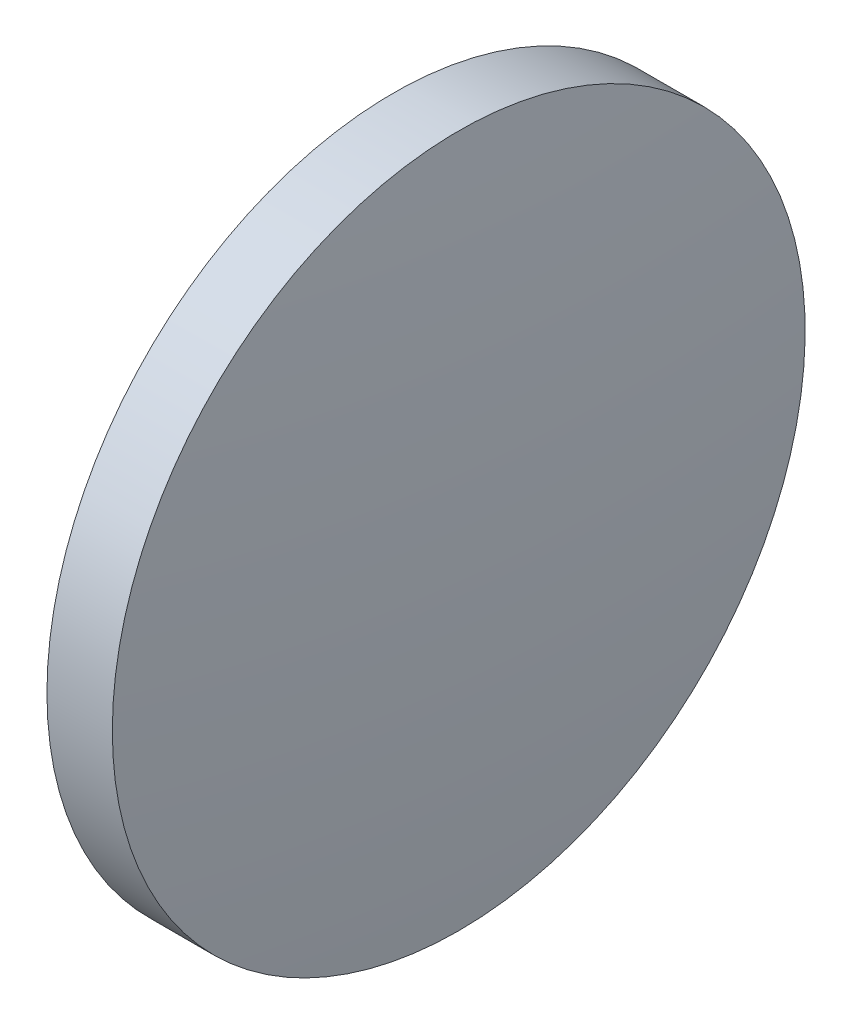
ISO-10303-21;
HEADER;
FILE_DESCRIPTION(('STEP AP214'),'2;1');
FILE_NAME('part.step','',(''),(''),'','','');
FILE_SCHEMA(('AUTOMOTIVE_DESIGN { 1 0 10303 214 1 1 1 1 }'));
ENDSEC;
DATA;
#1=APPLICATION_CONTEXT('core data for automotive mechanical design processes');
#2=APPLICATION_PROTOCOL_DEFINITION('international standard','automotive_design',2000,#1);
#3=PRODUCT_CONTEXT('',#1,'mechanical');
#4=PRODUCT('Part','Part','',(#3));
#5=PRODUCT_RELATED_PRODUCT_CATEGORY('part','',(#4));
#6=PRODUCT_DEFINITION_FORMATION('','',#4);
#7=PRODUCT_DEFINITION_CONTEXT('part definition',#1,'design');
#8=PRODUCT_DEFINITION('design','',#6,#7);
#9=PRODUCT_DEFINITION_SHAPE('','',#8);
#10=(LENGTH_UNIT() NAMED_UNIT(*) SI_UNIT(.MILLI.,.METRE.));
#11=(NAMED_UNIT(*) PLANE_ANGLE_UNIT() SI_UNIT($,.RADIAN.));
#12=(NAMED_UNIT(*) SI_UNIT($,.STERADIAN.) SOLID_ANGLE_UNIT());
#13=UNCERTAINTY_MEASURE_WITH_UNIT(LENGTH_MEASURE(1.E-05),#10,'distance_accuracy_value','');
#14=(GEOMETRIC_REPRESENTATION_CONTEXT(3) GLOBAL_UNCERTAINTY_ASSIGNED_CONTEXT((#13)) GLOBAL_UNIT_ASSIGNED_CONTEXT((#10,
#11,#12)) REPRESENTATION_CONTEXT('',''));
#15=CARTESIAN_POINT('',(0.,0.,0.));
#16=DIRECTION('',(0.,0.,1.));
#17=DIRECTION('',(1.,0.,0.));
#18=AXIS2_PLACEMENT_3D('',#15,#16,#17);
#19=CARTESIAN_POINT('',(598.654572220814,360.85081046143,0.));
#20=DIRECTION('',(-1.,0.,0.));
#21=DIRECTION('',(0.,-1.,0.));
#22=AXIS2_PLACEMENT_3D('',#19,#20,#21);
#23=SPHERICAL_SURFACE('',#22,82.2462820512824);
#24=CARTESIAN_POINT('',(680.510854272097,360.85081046143,0.));
#25=DIRECTION('',(-1.,0.,0.));
#26=DIRECTION('',(0.,0.,1.));
#27=AXIS2_PLACEMENT_3D('',#24,#25,#26);
#28=CIRCLE('',#27,7.99999999999995);
#29=CARTESIAN_POINT('',(680.510854272097,360.85081046143,7.99999999999995));
#30=VERTEX_POINT('',#29);
#31=EDGE_CURVE('E10',#30,#30,#28,.T.);
#32=ORIENTED_EDGE('',*,*,#31,.F.);
#33=EDGE_LOOP('',(#32));
#34=FACE_BOUND('',#33,.T.);
#35=ADVANCED_FACE('F33',(#34),#23,.T.);
#36=CARTESIAN_POINT('',(675.275585651734,360.85081046143,0.));
#37=DIRECTION('',(-1.,0.,0.));
#38=DIRECTION('',(0.,0.,1.));
#39=AXIS2_PLACEMENT_3D('',#36,#37,#38);
#40=CYLINDRICAL_SURFACE('',#39,7.99999999999995);
#41=CARTESIAN_POINT('',(679.000854272097,360.85081046143,0.));
#42=DIRECTION('',(-1.,0.,0.));
#43=DIRECTION('',(0.,0.,1.));
#44=AXIS2_PLACEMENT_3D('',#41,#42,#43);
#45=CIRCLE('',#44,7.99999999999995);
#46=CARTESIAN_POINT('',(679.000854272097,360.85081046143,7.99999999999995));
#47=VERTEX_POINT('',#46);
#48=EDGE_CURVE('E39',#47,#47,#45,.T.);
#49=ORIENTED_EDGE('',*,*,#48,.F.);
#50=EDGE_LOOP('',(#49));
#51=FACE_BOUND('',#50,.T.);
#52=ORIENTED_EDGE('',*,*,#31,.T.);
#53=EDGE_LOOP('',(#52));
#54=FACE_BOUND('',#53,.T.);
#55=ADVANCED_FACE('F47',(#51,#54),#40,.T.);
#56=CARTESIAN_POINT('',(679.000854272097,360.85081046143,0.));
#57=DIRECTION('',(1.,0.,0.));
#58=DIRECTION('',(0.,0.,-1.));
#59=AXIS2_PLACEMENT_3D('',#56,#57,#58);
#60=PLANE('',#59);
#61=ORIENTED_EDGE('',*,*,#48,.T.);
#62=EDGE_LOOP('',(#61));
#63=FACE_BOUND('',#62,.T.);
#64=ADVANCED_FACE('F45',(#63),#60,.F.);
#65=CLOSED_SHELL('',(#35,#55,#64));
#66=MANIFOLD_SOLID_BREP('B2',#65);
#67=ADVANCED_BREP_SHAPE_REPRESENTATION('',(#18,#66),#14);
#68=SHAPE_DEFINITION_REPRESENTATION(#9,#67);
ENDSEC;
END-ISO-10303-21;
